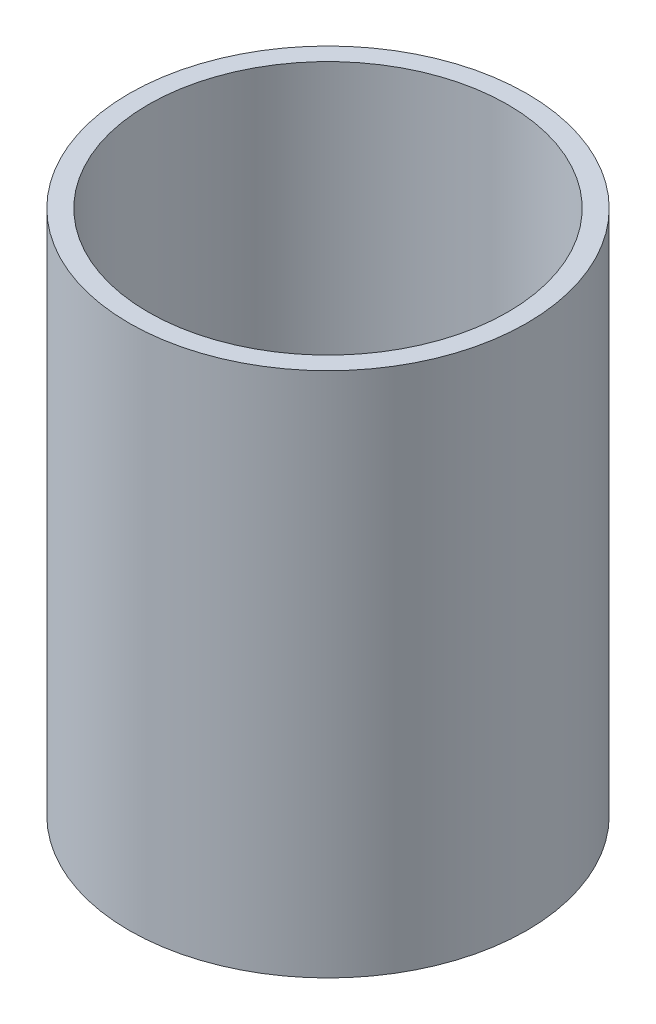
ISO-10303-21;
HEADER;
FILE_DESCRIPTION(('STEP AP214'),'2;1');
FILE_NAME('part.step','',(''),(''),'','','');
FILE_SCHEMA(('AUTOMOTIVE_DESIGN { 1 0 10303 214 1 1 1 1 }'));
ENDSEC;
DATA;
#1=APPLICATION_CONTEXT('core data for automotive mechanical design processes');
#2=APPLICATION_PROTOCOL_DEFINITION('international standard','automotive_design',2000,#1);
#3=PRODUCT_CONTEXT('',#1,'mechanical');
#4=PRODUCT('Part','Part','',(#3));
#5=PRODUCT_RELATED_PRODUCT_CATEGORY('part','',(#4));
#6=PRODUCT_DEFINITION_FORMATION('','',#4);
#7=PRODUCT_DEFINITION_CONTEXT('part definition',#1,'design');
#8=PRODUCT_DEFINITION('design','',#6,#7);
#9=PRODUCT_DEFINITION_SHAPE('','',#8);
#10=(LENGTH_UNIT() NAMED_UNIT(*) SI_UNIT(.MILLI.,.METRE.));
#11=(NAMED_UNIT(*) PLANE_ANGLE_UNIT() SI_UNIT($,.RADIAN.));
#12=(NAMED_UNIT(*) SI_UNIT($,.STERADIAN.) SOLID_ANGLE_UNIT());
#13=UNCERTAINTY_MEASURE_WITH_UNIT(LENGTH_MEASURE(1.E-05),#10,'distance_accuracy_value','');
#14=(GEOMETRIC_REPRESENTATION_CONTEXT(3) GLOBAL_UNCERTAINTY_ASSIGNED_CONTEXT((#13)) GLOBAL_UNIT_ASSIGNED_CONTEXT((#10,
#11,#12)) REPRESENTATION_CONTEXT('',''));
#15=CARTESIAN_POINT('',(0.,0.,0.));
#16=DIRECTION('',(0.,0.,1.));
#17=DIRECTION('',(1.,0.,0.));
#18=AXIS2_PLACEMENT_3D('',#15,#16,#17);
#19=CARTESIAN_POINT('',(0.,33.06,0.));
#20=DIRECTION('',(0.,1.,0.));
#21=DIRECTION('',(0.,0.,1.));
#22=AXIS2_PLACEMENT_3D('',#19,#20,#21);
#23=PLANE('',#22);
#24=CARTESIAN_POINT('',(0.,33.06,0.));
#25=DIRECTION('',(0.,1.,0.));
#26=DIRECTION('',(0.,0.,1.));
#27=AXIS2_PLACEMENT_3D('',#24,#25,#26);
#28=CIRCLE('',#27,25.);
#29=CARTESIAN_POINT('',(0.,33.06,25.));
#30=VERTEX_POINT('',#29);
#31=EDGE_CURVE('E10',#30,#30,#28,.T.);
#32=ORIENTED_EDGE('',*,*,#31,.T.);
#33=EDGE_LOOP('',(#32));
#34=FACE_BOUND('',#33,.T.);
#35=CARTESIAN_POINT('',(0.,33.06,0.));
#36=DIRECTION('',(0.,1.,0.));
#37=DIRECTION('',(0.,0.,1.));
#38=AXIS2_PLACEMENT_3D('',#35,#36,#37);
#39=CIRCLE('',#38,22.6);
#40=CARTESIAN_POINT('',(0.,33.06,22.6));
#41=VERTEX_POINT('',#40);
#42=EDGE_CURVE('E42',#41,#41,#39,.T.);
#43=ORIENTED_EDGE('',*,*,#42,.F.);
#44=EDGE_LOOP('',(#43));
#45=FACE_BOUND('',#44,.T.);
#46=ADVANCED_FACE('F31',(#34,#45),#23,.T.);
#47=CARTESIAN_POINT('',(0.,-33.06,0.));
#48=DIRECTION('',(0.,1.,0.));
#49=DIRECTION('',(0.,0.,1.));
#50=AXIS2_PLACEMENT_3D('',#47,#48,#49);
#51=PLANE('',#50);
#52=CARTESIAN_POINT('',(0.,-33.06,0.));
#53=DIRECTION('',(0.,1.,0.));
#54=DIRECTION('',(0.,0.,1.));
#55=AXIS2_PLACEMENT_3D('',#52,#53,#54);
#56=CIRCLE('',#55,25.);
#57=CARTESIAN_POINT('',(0.,-33.06,25.));
#58=VERTEX_POINT('',#57);
#59=EDGE_CURVE('E35',#58,#58,#56,.T.);
#60=ORIENTED_EDGE('',*,*,#59,.F.);
#61=EDGE_LOOP('',(#60));
#62=FACE_BOUND('',#61,.T.);
#63=CARTESIAN_POINT('',(0.,-33.06,0.));
#64=DIRECTION('',(0.,1.,0.));
#65=DIRECTION('',(0.,0.,1.));
#66=AXIS2_PLACEMENT_3D('',#63,#64,#65);
#67=CIRCLE('',#66,22.6);
#68=CARTESIAN_POINT('',(0.,-33.06,22.6));
#69=VERTEX_POINT('',#68);
#70=EDGE_CURVE('E44',#69,#69,#67,.T.);
#71=ORIENTED_EDGE('',*,*,#70,.T.);
#72=EDGE_LOOP('',(#71));
#73=FACE_BOUND('',#72,.T.);
#74=ADVANCED_FACE('F54',(#62,#73),#51,.F.);
#75=CARTESIAN_POINT('',(0.,33.06,0.));
#76=DIRECTION('',(0.,-1.,0.));
#77=DIRECTION('',(0.,0.,-1.));
#78=AXIS2_PLACEMENT_3D('',#75,#76,#77);
#79=CYLINDRICAL_SURFACE('',#78,25.);
#80=ORIENTED_EDGE('',*,*,#31,.F.);
#81=EDGE_LOOP('',(#80));
#82=FACE_BOUND('',#81,.T.);
#83=ORIENTED_EDGE('',*,*,#59,.T.);
#84=EDGE_LOOP('',(#83));
#85=FACE_BOUND('',#84,.T.);
#86=ADVANCED_FACE('F33',(#82,#85),#79,.T.);
#87=CARTESIAN_POINT('',(0.,33.06,0.));
#88=DIRECTION('',(0.,-1.,0.));
#89=DIRECTION('',(0.,0.,-1.));
#90=AXIS2_PLACEMENT_3D('',#87,#88,#89);
#91=CYLINDRICAL_SURFACE('',#90,22.6);
#92=ORIENTED_EDGE('',*,*,#42,.T.);
#93=EDGE_LOOP('',(#92));
#94=FACE_BOUND('',#93,.T.);
#95=ORIENTED_EDGE('',*,*,#70,.F.);
#96=EDGE_LOOP('',(#95));
#97=FACE_BOUND('',#96,.T.);
#98=ADVANCED_FACE('F50',(#94,#97),#91,.F.);
#99=CLOSED_SHELL('',(#46,#74,#86,#98));
#100=MANIFOLD_SOLID_BREP('B2',#99);
#101=ADVANCED_BREP_SHAPE_REPRESENTATION('',(#18,#100),#14);
#102=SHAPE_DEFINITION_REPRESENTATION(#9,#101);
ENDSEC;
END-ISO-10303-21;
